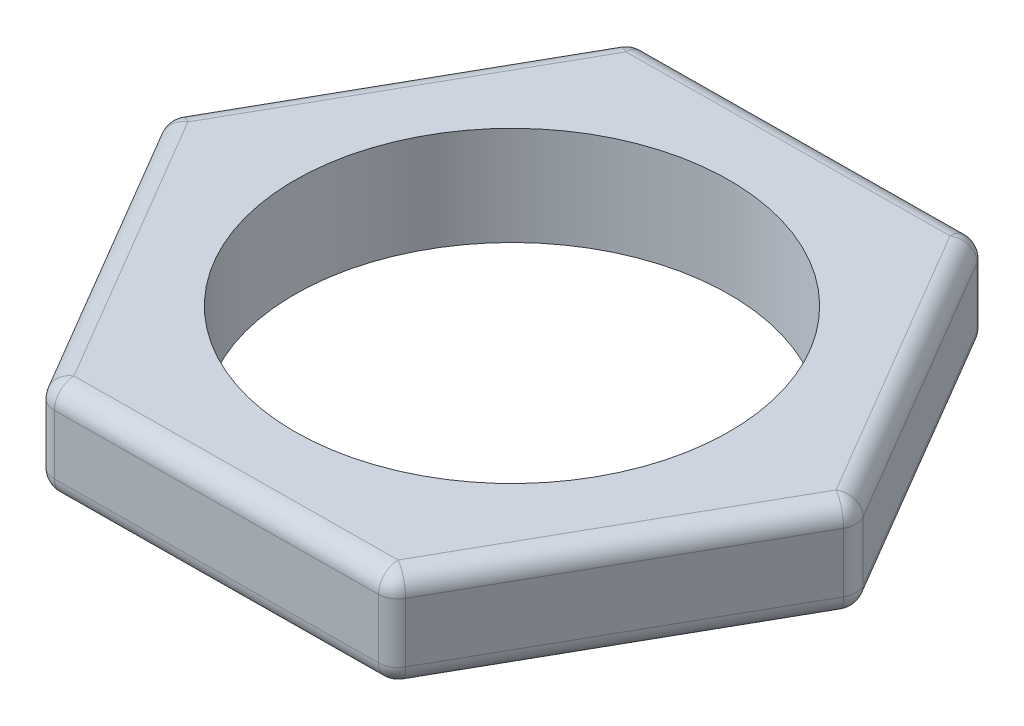
ISO-10303-21;
HEADER;
FILE_DESCRIPTION(('STEP AP214'),'2;1');
FILE_NAME('part.step','',(''),(''),'','','');
FILE_SCHEMA(('AUTOMOTIVE_DESIGN { 1 0 10303 214 1 1 1 1 }'));
ENDSEC;
DATA;
#1=APPLICATION_CONTEXT('core data for automotive mechanical design processes');
#2=APPLICATION_PROTOCOL_DEFINITION('international standard','automotive_design',2000,#1);
#3=PRODUCT_CONTEXT('',#1,'mechanical');
#4=PRODUCT('Part','Part','',(#3));
#5=PRODUCT_RELATED_PRODUCT_CATEGORY('part','',(#4));
#6=PRODUCT_DEFINITION_FORMATION('','',#4);
#7=PRODUCT_DEFINITION_CONTEXT('part definition',#1,'design');
#8=PRODUCT_DEFINITION('design','',#6,#7);
#9=PRODUCT_DEFINITION_SHAPE('','',#8);
#10=(LENGTH_UNIT() NAMED_UNIT(*) SI_UNIT(.MILLI.,.METRE.));
#11=(NAMED_UNIT(*) PLANE_ANGLE_UNIT() SI_UNIT($,.RADIAN.));
#12=(NAMED_UNIT(*) SI_UNIT($,.STERADIAN.) SOLID_ANGLE_UNIT());
#13=UNCERTAINTY_MEASURE_WITH_UNIT(LENGTH_MEASURE(1.E-05),#10,'distance_accuracy_value','');
#14=(GEOMETRIC_REPRESENTATION_CONTEXT(3) GLOBAL_UNCERTAINTY_ASSIGNED_CONTEXT((#13)) GLOBAL_UNIT_ASSIGNED_CONTEXT((#10,
#11,#12)) REPRESENTATION_CONTEXT('',''));
#15=CARTESIAN_POINT('',(0.,0.,0.));
#16=DIRECTION('',(0.,0.,1.));
#17=DIRECTION('',(1.,0.,0.));
#18=AXIS2_PLACEMENT_3D('',#15,#16,#17);
#19=CARTESIAN_POINT('',(16.2508062974145,5.,-0.13738888586725));
#20=DIRECTION('',(0.,1.,0.));
#21=DIRECTION('',(0.,0.,1.));
#22=AXIS2_PLACEMENT_3D('',#19,#20,#21);
#23=CYLINDRICAL_SURFACE('',#22,1.);
#24=CARTESIAN_POINT('',(16.2508062974145,4.,-0.137388885867251));
#25=DIRECTION('',(0.,1.,0.));
#26=DIRECTION('',(0.,0.,1.));
#27=AXIS2_PLACEMENT_3D('',#24,#25,#26);
#28=CIRCLE('',#27,1.);
#29=CARTESIAN_POINT('',(17.121027742863,4.,0.355271885740903));
#30=VERTEX_POINT('',#29);
#31=CARTESIAN_POINT('',(17.1125737637995,4.,-0.64469237873958));
#32=VERTEX_POINT('',#31);
#33=EDGE_CURVE('E11',#30,#32,#28,.T.);
#34=ORIENTED_EDGE('',*,*,#33,.F.);
#35=DIRECTION('',(0.,1.,0.));
#36=VECTOR('',#35,1.);
#37=CARTESIAN_POINT('',(17.121027742863,5.,0.355271885740902));
#38=LINE('',#37,#36);
#39=CARTESIAN_POINT('',(17.121027742863,1.,0.355271885740898));
#40=VERTEX_POINT('',#39);
#41=EDGE_CURVE('E358',#40,#30,#38,.T.);
#42=ORIENTED_EDGE('',*,*,#41,.F.);
#43=CARTESIAN_POINT('',(16.2508062974145,1.,-0.137388885867248));
#44=DIRECTION('',(0.,1.,0.));
#45=DIRECTION('',(0.,0.,1.));
#46=AXIS2_PLACEMENT_3D('',#43,#44,#45);
#47=CIRCLE('',#46,1.);
#48=CARTESIAN_POINT('',(17.1125737637995,1.,-0.64469237873958));
#49=VERTEX_POINT('',#48);
#50=EDGE_CURVE('E43',#40,#49,#47,.T.);
#51=ORIENTED_EDGE('',*,*,#50,.T.);
#52=DIRECTION('',(0.,1.,0.));
#53=VECTOR('',#52,1.);
#54=CARTESIAN_POINT('',(17.1125737637995,5.,-0.644692378739582));
#55=LINE('',#54,#53);
#56=EDGE_CURVE('E361',#32,#49,#55,.F.);
#57=ORIENTED_EDGE('',*,*,#56,.F.);
#58=EDGE_LOOP('',(#34,#42,#51,#57));
#59=FACE_BOUND('',#58,.T.);
#60=ADVANCED_FACE('F35',(#59),#23,.T.);
#61=CARTESIAN_POINT('',(16.2508062974145,1.,-0.137388885867248));
#62=DIRECTION('',(0.,0.,1.));
#63=DIRECTION('',(1.,0.,0.));
#64=AXIS2_PLACEMENT_3D('',#61,#62,#63);
#65=SPHERICAL_SURFACE('',#64,1.);
#66=ORIENTED_EDGE('',*,*,#50,.F.);
#67=CARTESIAN_POINT('',(16.2508062974145,1.,-0.137388885867249));
#68=DIRECTION('',(-0.492660771608151,0.,0.870221445448491));
#69=DIRECTION('',(0.870221445448491,0.,0.492660771608151));
#70=AXIS2_PLACEMENT_3D('',#67,#68,#69);
#71=CIRCLE('',#70,1.);
#72=CARTESIAN_POINT('',(16.2508062974145,0.,-0.137388885867252));
#73=VERTEX_POINT('',#72);
#74=EDGE_CURVE('E353',#73,#40,#71,.T.);
#75=ORIENTED_EDGE('',*,*,#74,.F.);
#76=CARTESIAN_POINT('',(16.2508062974145,1.,-0.137388885867249));
#77=DIRECTION('',(0.507303492872332,0.,0.861767466384948));
#78=DIRECTION('',(0.861767466384948,0.,-0.507303492872332));
#79=AXIS2_PLACEMENT_3D('',#76,#77,#78);
#80=CIRCLE('',#79,1.);
#81=EDGE_CURVE('E356',#49,#73,#80,.F.);
#82=ORIENTED_EDGE('',*,*,#81,.F.);
#83=EDGE_LOOP('',(#66,#75,#82));
#84=FACE_BOUND('',#83,.T.);
#85=ADVANCED_FACE('F376',(#84),#65,.T.);
#86=CARTESIAN_POINT('',(16.2508062974145,4.,-0.137388885867248));
#87=DIRECTION('',(0.,0.,1.));
#88=DIRECTION('',(1.,0.,0.));
#89=AXIS2_PLACEMENT_3D('',#86,#87,#88);
#90=SPHERICAL_SURFACE('',#89,1.);
#91=CARTESIAN_POINT('',(16.2508062974145,4.,-0.137388885867249));
#92=DIRECTION('',(-0.492660771608151,0.,0.870221445448491));
#93=DIRECTION('',(0.870221445448491,0.,0.492660771608151));
#94=AXIS2_PLACEMENT_3D('',#91,#92,#93);
#95=CIRCLE('',#94,1.);
#96=CARTESIAN_POINT('',(16.2508062974145,5.,-0.137388885867252));
#97=VERTEX_POINT('',#96);
#98=EDGE_CURVE('E364',#30,#97,#95,.T.);
#99=ORIENTED_EDGE('',*,*,#98,.F.);
#100=ORIENTED_EDGE('',*,*,#33,.T.);
#101=CARTESIAN_POINT('',(16.2508062974145,4.,-0.137388885867249));
#102=DIRECTION('',(0.507303492872332,0.,0.861767466384948));
#103=DIRECTION('',(0.861767466384948,0.,-0.507303492872332));
#104=AXIS2_PLACEMENT_3D('',#101,#102,#103);
#105=CIRCLE('',#104,1.);
#106=EDGE_CURVE('E367',#97,#32,#105,.F.);
#107=ORIENTED_EDGE('',*,*,#106,.F.);
#108=EDGE_LOOP('',(#99,#100,#107));
#109=FACE_BOUND('',#108,.T.);
#110=ADVANCED_FACE('F37',(#109),#90,.T.);
#111=CARTESIAN_POINT('',(8.0064208833486,5.,-14.1423055284747));
#112=DIRECTION('',(0.,1.,0.));
#113=DIRECTION('',(0.,0.,1.));
#114=AXIS2_PLACEMENT_3D('',#111,#112,#113);
#115=CYLINDRICAL_SURFACE('',#114,1.);
#116=CARTESIAN_POINT('',(8.00642088334859,4.,-14.1423055284748));
#117=DIRECTION('',(0.,1.,0.));
#118=DIRECTION('',(0.,0.,1.));
#119=AXIS2_PLACEMENT_3D('',#116,#117,#118);
#120=CIRCLE('',#119,1.);
#121=CARTESIAN_POINT('',(8.86818834973354,4.,-14.6496090213471));
#122=VERTEX_POINT('',#121);
#123=CARTESIAN_POINT('',(7.99796690428505,4.,-15.1422697929552));
#124=VERTEX_POINT('',#123);
#125=EDGE_CURVE('E351',#122,#124,#120,.T.);
#126=ORIENTED_EDGE('',*,*,#125,.F.);
#127=DIRECTION('',(0.,1.,0.));
#128=VECTOR('',#127,1.);
#129=CARTESIAN_POINT('',(8.86818834973354,5.,-14.6496090213471));
#130=LINE('',#129,#128);
#131=CARTESIAN_POINT('',(8.86818834973354,1.,-14.6496090213471));
#132=VERTEX_POINT('',#131);
#133=EDGE_CURVE('E337',#132,#122,#130,.T.);
#134=ORIENTED_EDGE('',*,*,#133,.F.);
#135=CARTESIAN_POINT('',(8.0064208833486,1.,-14.1423055284748));
#136=DIRECTION('',(0.,1.,0.));
#137=DIRECTION('',(0.,0.,1.));
#138=AXIS2_PLACEMENT_3D('',#135,#136,#137);
#139=CIRCLE('',#138,1.);
#140=CARTESIAN_POINT('',(7.99796690428505,1.,-15.1422697929552));
#141=VERTEX_POINT('',#140);
#142=EDGE_CURVE('E349',#132,#141,#139,.T.);
#143=ORIENTED_EDGE('',*,*,#142,.T.);
#144=DIRECTION('',(0.,1.,0.));
#145=VECTOR('',#144,1.);
#146=CARTESIAN_POINT('',(7.99796690428505,5.,-15.1422697929552));
#147=LINE('',#146,#145);
#148=EDGE_CURVE('E340',#124,#141,#147,.F.);
#149=ORIENTED_EDGE('',*,*,#148,.F.);
#150=EDGE_LOOP('',(#126,#134,#143,#149));
#151=FACE_BOUND('',#150,.T.);
#152=ADVANCED_FACE('F410',(#151),#115,.T.);
#153=CARTESIAN_POINT('',(8.0064208833486,1.,-14.1423055284748));
#154=DIRECTION('',(0.,0.,1.));
#155=DIRECTION('',(1.,0.,0.));
#156=AXIS2_PLACEMENT_3D('',#153,#154,#155);
#157=SPHERICAL_SURFACE('',#156,1.);
#158=ORIENTED_EDGE('',*,*,#142,.F.);
#159=CARTESIAN_POINT('',(8.0064208833486,1.,-14.1423055284748));
#160=DIRECTION('',(0.507303492872332,0.,0.861767466384948));
#161=DIRECTION('',(0.861767466384948,0.,-0.507303492872332));
#162=AXIS2_PLACEMENT_3D('',#159,#160,#161);
#163=CIRCLE('',#162,1.);
#164=CARTESIAN_POINT('',(8.0064208833486,0.,-14.1423055284747));
#165=VERTEX_POINT('',#164);
#166=EDGE_CURVE('E332',#165,#132,#163,.T.);
#167=ORIENTED_EDGE('',*,*,#166,.F.);
#168=CARTESIAN_POINT('',(8.0064208833486,1.,-14.1423055284748));
#169=DIRECTION('',(0.999964264480483,0.,-0.00845397906354309));
#170=DIRECTION('',(-0.00845397906354309,0.,-0.999964264480483));
#171=AXIS2_PLACEMENT_3D('',#168,#169,#170);
#172=CIRCLE('',#171,1.);
#173=EDGE_CURVE('E335',#141,#165,#172,.F.);
#174=ORIENTED_EDGE('',*,*,#173,.F.);
#175=EDGE_LOOP('',(#158,#167,#174));
#176=FACE_BOUND('',#175,.T.);
#177=ADVANCED_FACE('F383',(#176),#157,.T.);
#178=CARTESIAN_POINT('',(8.0064208833486,4.,-14.1423055284748));
#179=DIRECTION('',(0.,0.,1.));
#180=DIRECTION('',(1.,0.,0.));
#181=AXIS2_PLACEMENT_3D('',#178,#179,#180);
#182=SPHERICAL_SURFACE('',#181,1.);
#183=CARTESIAN_POINT('',(8.0064208833486,4.,-14.1423055284748));
#184=DIRECTION('',(0.507303492872332,0.,0.861767466384948));
#185=DIRECTION('',(0.861767466384948,0.,-0.507303492872332));
#186=AXIS2_PLACEMENT_3D('',#183,#184,#185);
#187=CIRCLE('',#186,1.);
#188=CARTESIAN_POINT('',(8.00642088334859,5.,-14.1423055284748));
#189=VERTEX_POINT('',#188);
#190=EDGE_CURVE('E343',#122,#189,#187,.T.);
#191=ORIENTED_EDGE('',*,*,#190,.F.);
#192=ORIENTED_EDGE('',*,*,#125,.T.);
#193=CARTESIAN_POINT('',(8.0064208833486,4.,-14.1423055284748));
#194=DIRECTION('',(0.999964264480483,0.,-0.00845397906354309));
#195=DIRECTION('',(-0.00845397906354309,0.,-0.999964264480483));
#196=AXIS2_PLACEMENT_3D('',#193,#194,#195);
#197=CIRCLE('',#196,1.);
#198=EDGE_CURVE('E346',#189,#124,#197,.F.);
#199=ORIENTED_EDGE('',*,*,#198,.F.);
#200=EDGE_LOOP('',(#191,#192,#199));
#201=FACE_BOUND('',#200,.T.);
#202=ADVANCED_FACE('F449',(#201),#182,.T.);
#203=CARTESIAN_POINT('',(-8.24438541406595,5.,-14.0049166426075));
#204=DIRECTION('',(0.,-1.,0.));
#205=DIRECTION('',(0.,0.,-1.));
#206=AXIS2_PLACEMENT_3D('',#203,#204,#205);
#207=CYLINDRICAL_SURFACE('',#206,1.);
#208=CARTESIAN_POINT('',(-8.24438541406595,1.,-14.0049166426075));
#209=DIRECTION('',(0.,-1.,0.));
#210=DIRECTION('',(0.,0.,-1.));
#211=AXIS2_PLACEMENT_3D('',#208,#209,#210);
#212=CIRCLE('',#211,1.);
#213=CARTESIAN_POINT('',(-9.11460685951443,1.,-14.4975774142157));
#214=VERTEX_POINT('',#213);
#215=CARTESIAN_POINT('',(-8.25283939312948,1.,-15.004880907088));
#216=VERTEX_POINT('',#215);
#217=EDGE_CURVE('E329',#214,#216,#212,.T.);
#218=ORIENTED_EDGE('',*,*,#217,.F.);
#219=DIRECTION('',(0.,-1.,0.));
#220=VECTOR('',#219,1.);
#221=CARTESIAN_POINT('',(-9.11460685951444,5.,-14.4975774142156));
#222=LINE('',#221,#220);
#223=CARTESIAN_POINT('',(-9.11460685951444,4.,-14.4975774142157));
#224=VERTEX_POINT('',#223);
#225=EDGE_CURVE('E315',#224,#214,#222,.T.);
#226=ORIENTED_EDGE('',*,*,#225,.F.);
#227=CARTESIAN_POINT('',(-8.24438541406594,4.,-14.0049166426075));
#228=DIRECTION('',(0.,-1.,0.));
#229=DIRECTION('',(0.,0.,-1.));
#230=AXIS2_PLACEMENT_3D('',#227,#228,#229);
#231=CIRCLE('',#230,1.);
#232=CARTESIAN_POINT('',(-8.25283939312949,4.,-15.004880907088));
#233=VERTEX_POINT('',#232);
#234=EDGE_CURVE('E327',#224,#233,#231,.T.);
#235=ORIENTED_EDGE('',*,*,#234,.T.);
#236=DIRECTION('',(0.,-1.,0.));
#237=VECTOR('',#236,1.);
#238=CARTESIAN_POINT('',(-8.25283939312949,5.,-15.004880907088));
#239=LINE('',#238,#237);
#240=EDGE_CURVE('E318',#216,#233,#239,.F.);
#241=ORIENTED_EDGE('',*,*,#240,.F.);
#242=EDGE_LOOP('',(#218,#226,#235,#241));
#243=FACE_BOUND('',#242,.T.);
#244=ADVANCED_FACE('F399',(#243),#207,.T.);
#245=CARTESIAN_POINT('',(-8.24438541406594,4.,-14.0049166426075));
#246=DIRECTION('',(0.,0.,1.));
#247=DIRECTION('',(1.,0.,0.));
#248=AXIS2_PLACEMENT_3D('',#245,#246,#247);
#249=SPHERICAL_SURFACE('',#248,1.);
#250=ORIENTED_EDGE('',*,*,#234,.F.);
#251=CARTESIAN_POINT('',(-8.24438541406594,4.,-14.0049166426075));
#252=DIRECTION('',(0.492660771608151,0.,-0.870221445448491));
#253=DIRECTION('',(-0.870221445448491,0.,-0.492660771608151));
#254=AXIS2_PLACEMENT_3D('',#251,#252,#253);
#255=CIRCLE('',#254,1.);
#256=CARTESIAN_POINT('',(-8.24438541406594,5.,-14.0049166426075));
#257=VERTEX_POINT('',#256);
#258=EDGE_CURVE('E310',#257,#224,#255,.F.);
#259=ORIENTED_EDGE('',*,*,#258,.F.);
#260=CARTESIAN_POINT('',(-8.24438541406594,4.,-14.0049166426075));
#261=DIRECTION('',(0.999964264480483,0.,-0.00845397906354309));
#262=DIRECTION('',(-0.00845397906354309,0.,-0.999964264480483));
#263=AXIS2_PLACEMENT_3D('',#260,#261,#262);
#264=CIRCLE('',#263,1.);
#265=EDGE_CURVE('E313',#233,#257,#264,.T.);
#266=ORIENTED_EDGE('',*,*,#265,.F.);
#267=EDGE_LOOP('',(#250,#259,#266));
#268=FACE_BOUND('',#267,.T.);
#269=ADVANCED_FACE('F402',(#268),#249,.T.);
#270=CARTESIAN_POINT('',(-8.24438541406594,1.,-14.0049166426075));
#271=DIRECTION('',(0.,0.,1.));
#272=DIRECTION('',(1.,0.,0.));
#273=AXIS2_PLACEMENT_3D('',#270,#271,#272);
#274=SPHERICAL_SURFACE('',#273,1.);
#275=CARTESIAN_POINT('',(-8.24438541406594,1.,-14.0049166426075));
#276=DIRECTION('',(0.492660771608151,0.,-0.870221445448491));
#277=DIRECTION('',(-0.870221445448491,0.,-0.492660771608151));
#278=AXIS2_PLACEMENT_3D('',#275,#276,#277);
#279=CIRCLE('',#278,1.);
#280=CARTESIAN_POINT('',(-8.24438541406595,0.,-14.0049166426075));
#281=VERTEX_POINT('',#280);
#282=EDGE_CURVE('E321',#214,#281,#279,.F.);
#283=ORIENTED_EDGE('',*,*,#282,.F.);
#284=ORIENTED_EDGE('',*,*,#217,.T.);
#285=CARTESIAN_POINT('',(-8.24438541406594,1.,-14.0049166426075));
#286=DIRECTION('',(0.999964264480483,0.,-0.00845397906354309));
#287=DIRECTION('',(-0.00845397906354309,0.,-0.999964264480483));
#288=AXIS2_PLACEMENT_3D('',#285,#286,#287);
#289=CIRCLE('',#288,1.);
#290=EDGE_CURVE('E324',#281,#216,#289,.T.);
#291=ORIENTED_EDGE('',*,*,#290,.F.);
#292=EDGE_LOOP('',(#283,#284,#291));
#293=FACE_BOUND('',#292,.T.);
#294=ADVANCED_FACE('F396',(#293),#274,.T.);
#295=CARTESIAN_POINT('',(-16.2508062974145,5.,0.137388885867248));
#296=DIRECTION('',(0.,-1.,0.));
#297=DIRECTION('',(0.,0.,-1.));
#298=AXIS2_PLACEMENT_3D('',#295,#296,#297);
#299=CYLINDRICAL_SURFACE('',#298,1.);
#300=CARTESIAN_POINT('',(-16.2508062974145,1.,0.137388885867246));
#301=DIRECTION('',(0.,-1.,0.));
#302=DIRECTION('',(0.,0.,-1.));
#303=AXIS2_PLACEMENT_3D('',#300,#301,#302);
#304=CIRCLE('',#303,1.);
#305=CARTESIAN_POINT('',(-17.1125737637995,1.,0.644692378739582));
#306=VERTEX_POINT('',#305);
#307=CARTESIAN_POINT('',(-17.121027742863,1.,-0.355271885740903));
#308=VERTEX_POINT('',#307);
#309=EDGE_CURVE('E307',#306,#308,#304,.T.);
#310=ORIENTED_EDGE('',*,*,#309,.F.);
#311=DIRECTION('',(0.,-1.,0.));
#312=VECTOR('',#311,1.);
#313=CARTESIAN_POINT('',(-17.1125737637995,5.,0.64469237873958));
#314=LINE('',#313,#312);
#315=CARTESIAN_POINT('',(-17.1125737637995,4.,0.64469237873958));
#316=VERTEX_POINT('',#315);
#317=EDGE_CURVE('E295',#316,#306,#314,.T.);
#318=ORIENTED_EDGE('',*,*,#317,.F.);
#319=CARTESIAN_POINT('',(-16.2508062974145,4.,0.13738888586725));
#320=DIRECTION('',(0.,-1.,0.));
#321=DIRECTION('',(0.,0.,-1.));
#322=AXIS2_PLACEMENT_3D('',#319,#320,#321);
#323=CIRCLE('',#322,1.);
#324=CARTESIAN_POINT('',(-17.121027742863,4.,-0.355271885740904));
#325=VERTEX_POINT('',#324);
#326=EDGE_CURVE('E305',#316,#325,#323,.T.);
#327=ORIENTED_EDGE('',*,*,#326,.T.);
#328=DIRECTION('',(0.,-1.,0.));
#329=VECTOR('',#328,1.);
#330=CARTESIAN_POINT('',(-17.121027742863,5.,-0.355271885740907));
#331=LINE('',#330,#329);
#332=EDGE_CURVE('E298',#308,#325,#331,.F.);
#333=ORIENTED_EDGE('',*,*,#332,.F.);
#334=EDGE_LOOP('',(#310,#318,#327,#333));
#335=FACE_BOUND('',#334,.T.);
#336=ADVANCED_FACE('F458',(#335),#299,.T.);
#337=CARTESIAN_POINT('',(-16.2508062974145,4.,0.13738888586725));
#338=DIRECTION('',(0.,0.,1.));
#339=DIRECTION('',(1.,0.,0.));
#340=AXIS2_PLACEMENT_3D('',#337,#338,#339);
#341=SPHERICAL_SURFACE('',#340,1.);
#342=ORIENTED_EDGE('',*,*,#326,.F.);
#343=CARTESIAN_POINT('',(-16.2508062974145,4.,0.137388885867251));
#344=DIRECTION('',(-0.507303492872331,0.,-0.861767466384948));
#345=DIRECTION('',(-0.861767466384948,0.,0.507303492872331));
#346=AXIS2_PLACEMENT_3D('',#343,#344,#345);
#347=CIRCLE('',#346,1.);
#348=CARTESIAN_POINT('',(-16.2508062974145,5.,0.137388885867245));
#349=VERTEX_POINT('',#348);
#350=EDGE_CURVE('E290',#349,#316,#347,.F.);
#351=ORIENTED_EDGE('',*,*,#350,.F.);
#352=CARTESIAN_POINT('',(-16.2508062974145,4.,0.137388885867248));
#353=DIRECTION('',(0.492660771608151,0.,-0.870221445448491));
#354=DIRECTION('',(-0.870221445448491,0.,-0.492660771608151));
#355=AXIS2_PLACEMENT_3D('',#352,#353,#354);
#356=CIRCLE('',#355,1.);
#357=EDGE_CURVE('E293',#325,#349,#356,.T.);
#358=ORIENTED_EDGE('',*,*,#357,.F.);
#359=EDGE_LOOP('',(#342,#351,#358));
#360=FACE_BOUND('',#359,.T.);
#361=ADVANCED_FACE('F467',(#360),#341,.T.);
#362=CARTESIAN_POINT('',(-16.2508062974145,1.,0.13738888586725));
#363=DIRECTION('',(0.,0.,1.));
#364=DIRECTION('',(1.,0.,0.));
#365=AXIS2_PLACEMENT_3D('',#362,#363,#364);
#366=SPHERICAL_SURFACE('',#365,1.);
#367=CARTESIAN_POINT('',(-16.2508062974145,1.,0.137388885867251));
#368=DIRECTION('',(-0.507303492872331,0.,-0.861767466384948));
#369=DIRECTION('',(-0.861767466384948,0.,0.507303492872331));
#370=AXIS2_PLACEMENT_3D('',#367,#368,#369);
#371=CIRCLE('',#370,1.);
#372=CARTESIAN_POINT('',(-16.2508062974145,0.,0.137388885867245));
#373=VERTEX_POINT('',#372);
#374=EDGE_CURVE('E194',#306,#373,#371,.F.);
#375=ORIENTED_EDGE('',*,*,#374,.F.);
#376=ORIENTED_EDGE('',*,*,#309,.T.);
#377=CARTESIAN_POINT('',(-16.2508062974145,1.,0.137388885867248));
#378=DIRECTION('',(0.492660771608151,0.,-0.870221445448491));
#379=DIRECTION('',(-0.870221445448491,0.,-0.492660771608151));
#380=AXIS2_PLACEMENT_3D('',#377,#378,#379);
#381=CIRCLE('',#380,1.);
#382=EDGE_CURVE('E302',#373,#308,#381,.T.);
#383=ORIENTED_EDGE('',*,*,#382,.F.);
#384=EDGE_LOOP('',(#375,#376,#383));
#385=FACE_BOUND('',#384,.T.);
#386=ADVANCED_FACE('F463',(#385),#366,.T.);
#387=CARTESIAN_POINT('',(-8.00642088334859,5.,14.1423055284748));
#388=DIRECTION('',(0.,-1.,0.));
#389=DIRECTION('',(0.,0.,-1.));
#390=AXIS2_PLACEMENT_3D('',#387,#388,#389);
#391=CYLINDRICAL_SURFACE('',#390,1.);
#392=CARTESIAN_POINT('',(-8.00642088334859,1.,14.1423055284748));
#393=DIRECTION('',(0.,-1.,0.));
#394=DIRECTION('',(0.,0.,-1.));
#395=AXIS2_PLACEMENT_3D('',#392,#393,#394);
#396=CIRCLE('',#395,1.);
#397=CARTESIAN_POINT('',(-7.99796690428504,1.,15.1422697929552));
#398=VERTEX_POINT('',#397);
#399=CARTESIAN_POINT('',(-8.86818834973353,1.,14.6496090213471));
#400=VERTEX_POINT('',#399);
#401=EDGE_CURVE('E163',#398,#400,#396,.T.);
#402=ORIENTED_EDGE('',*,*,#401,.F.);
#403=DIRECTION('',(0.,-1.,0.));
#404=VECTOR('',#403,1.);
#405=CARTESIAN_POINT('',(-7.99796690428504,5.,15.1422697929552));
#406=LINE('',#405,#404);
#407=CARTESIAN_POINT('',(-7.99796690428504,4.,15.1422697929552));
#408=VERTEX_POINT('',#407);
#409=EDGE_CURVE('E284',#408,#398,#406,.T.);
#410=ORIENTED_EDGE('',*,*,#409,.F.);
#411=CARTESIAN_POINT('',(-8.00642088334858,4.,14.1423055284748));
#412=DIRECTION('',(0.,-1.,0.));
#413=DIRECTION('',(0.,0.,-1.));
#414=AXIS2_PLACEMENT_3D('',#411,#412,#413);
#415=CIRCLE('',#414,1.);
#416=CARTESIAN_POINT('',(-8.86818834973353,4.,14.6496090213471));
#417=VERTEX_POINT('',#416);
#418=EDGE_CURVE('E168',#408,#417,#415,.T.);
#419=ORIENTED_EDGE('',*,*,#418,.T.);
#420=DIRECTION('',(0.,-1.,0.));
#421=VECTOR('',#420,1.);
#422=CARTESIAN_POINT('',(-8.86818834973353,5.,14.6496090213471));
#423=LINE('',#422,#421);
#424=EDGE_CURVE('E178',#400,#417,#423,.F.);
#425=ORIENTED_EDGE('',*,*,#424,.F.);
#426=EDGE_LOOP('',(#402,#410,#419,#425));
#427=FACE_BOUND('',#426,.T.);
#428=ADVANCED_FACE('F466',(#427),#391,.T.);
#429=CARTESIAN_POINT('',(-8.00642088334858,4.,14.1423055284748));
#430=DIRECTION('',(0.,0.,1.));
#431=DIRECTION('',(1.,0.,0.));
#432=AXIS2_PLACEMENT_3D('',#429,#430,#431);
#433=SPHERICAL_SURFACE('',#432,1.);
#434=ORIENTED_EDGE('',*,*,#418,.F.);
#435=CARTESIAN_POINT('',(-8.00642088334858,4.,14.1423055284748));
#436=DIRECTION('',(-0.999964264480483,0.,0.00845397906354309));
#437=DIRECTION('',(0.00845397906354309,0.,0.999964264480483));
#438=AXIS2_PLACEMENT_3D('',#435,#436,#437);
#439=CIRCLE('',#438,1.);
#440=CARTESIAN_POINT('',(-8.00642088334859,5.,14.1423055284748));
#441=VERTEX_POINT('',#440);
#442=EDGE_CURVE('E279',#441,#408,#439,.F.);
#443=ORIENTED_EDGE('',*,*,#442,.F.);
#444=CARTESIAN_POINT('',(-8.00642088334858,4.,14.1423055284748));
#445=DIRECTION('',(-0.507303492872331,0.,-0.861767466384948));
#446=DIRECTION('',(-0.861767466384948,0.,0.507303492872331));
#447=AXIS2_PLACEMENT_3D('',#444,#445,#446);
#448=CIRCLE('',#447,1.);
#449=EDGE_CURVE('E282',#417,#441,#448,.T.);
#450=ORIENTED_EDGE('',*,*,#449,.F.);
#451=EDGE_LOOP('',(#434,#443,#450));
#452=FACE_BOUND('',#451,.T.);
#453=ADVANCED_FACE('F477',(#452),#433,.T.);
#454=CARTESIAN_POINT('',(-8.00642088334858,1.,14.1423055284748));
#455=DIRECTION('',(0.,0.,1.));
#456=DIRECTION('',(1.,0.,0.));
#457=AXIS2_PLACEMENT_3D('',#454,#455,#456);
#458=SPHERICAL_SURFACE('',#457,1.);
#459=CARTESIAN_POINT('',(-8.00642088334858,1.,14.1423055284748));
#460=DIRECTION('',(-0.999964264480483,0.,0.00845397906354309));
#461=DIRECTION('',(0.00845397906354309,0.,0.999964264480483));
#462=AXIS2_PLACEMENT_3D('',#459,#460,#461);
#463=CIRCLE('',#462,1.);
#464=CARTESIAN_POINT('',(-8.00642088334858,0.,14.1423055284748));
#465=VERTEX_POINT('',#464);
#466=EDGE_CURVE('E161',#398,#465,#463,.F.);
#467=ORIENTED_EDGE('',*,*,#466,.F.);
#468=ORIENTED_EDGE('',*,*,#401,.T.);
#469=CARTESIAN_POINT('',(-8.00642088334858,1.,14.1423055284748));
#470=DIRECTION('',(-0.507303492872331,0.,-0.861767466384948));
#471=DIRECTION('',(-0.861767466384948,0.,0.507303492872331));
#472=AXIS2_PLACEMENT_3D('',#469,#470,#471);
#473=CIRCLE('',#472,1.);
#474=EDGE_CURVE('E158',#465,#400,#473,.T.);
#475=ORIENTED_EDGE('',*,*,#474,.F.);
#476=EDGE_LOOP('',(#467,#468,#475));
#477=FACE_BOUND('',#476,.T.);
#478=ADVANCED_FACE('F160',(#477),#458,.T.);
#479=CARTESIAN_POINT('',(8.24438541406595,5.,14.0049166426075));
#480=DIRECTION('',(0.,1.,0.));
#481=DIRECTION('',(0.,0.,1.));
#482=AXIS2_PLACEMENT_3D('',#479,#480,#481);
#483=CYLINDRICAL_SURFACE('',#482,1.);
#484=CARTESIAN_POINT('',(8.24438541406595,4.,14.0049166426075));
#485=DIRECTION('',(0.,1.,0.));
#486=DIRECTION('',(0.,0.,1.));
#487=AXIS2_PLACEMENT_3D('',#484,#485,#486);
#488=CIRCLE('',#487,1.);
#489=CARTESIAN_POINT('',(8.25283939312948,4.,15.004880907088));
#490=VERTEX_POINT('',#489);
#491=CARTESIAN_POINT('',(9.11460685951443,4.,14.4975774142157));
#492=VERTEX_POINT('',#491);
#493=EDGE_CURVE('E276',#490,#492,#488,.T.);
#494=ORIENTED_EDGE('',*,*,#493,.F.);
#495=DIRECTION('',(0.,1.,0.));
#496=VECTOR('',#495,1.);
#497=CARTESIAN_POINT('',(8.25283939312949,5.,15.004880907088));
#498=LINE('',#497,#496);
#499=CARTESIAN_POINT('',(8.25283939312949,1.,15.004880907088));
#500=VERTEX_POINT('',#499);
#501=EDGE_CURVE('E262',#500,#490,#498,.T.);
#502=ORIENTED_EDGE('',*,*,#501,.F.);
#503=CARTESIAN_POINT('',(8.24438541406594,1.,14.0049166426075));
#504=DIRECTION('',(0.,1.,0.));
#505=DIRECTION('',(0.,0.,1.));
#506=AXIS2_PLACEMENT_3D('',#503,#504,#505);
#507=CIRCLE('',#506,1.);
#508=CARTESIAN_POINT('',(9.11460685951444,1.,14.4975774142157));
#509=VERTEX_POINT('',#508);
#510=EDGE_CURVE('E274',#500,#509,#507,.T.);
#511=ORIENTED_EDGE('',*,*,#510,.T.);
#512=DIRECTION('',(0.,1.,0.));
#513=VECTOR('',#512,1.);
#514=CARTESIAN_POINT('',(9.11460685951444,5.,14.4975774142157));
#515=LINE('',#514,#513);
#516=EDGE_CURVE('E265',#492,#509,#515,.F.);
#517=ORIENTED_EDGE('',*,*,#516,.F.);
#518=EDGE_LOOP('',(#494,#502,#511,#517));
#519=FACE_BOUND('',#518,.T.);
#520=ADVANCED_FACE('F427',(#519),#483,.T.);
#521=CARTESIAN_POINT('',(8.24438541406594,1.,14.0049166426075));
#522=DIRECTION('',(0.,0.,1.));
#523=DIRECTION('',(1.,0.,0.));
#524=AXIS2_PLACEMENT_3D('',#521,#522,#523);
#525=SPHERICAL_SURFACE('',#524,1.);
#526=ORIENTED_EDGE('',*,*,#510,.F.);
#527=CARTESIAN_POINT('',(8.24438541406594,1.,14.0049166426075));
#528=DIRECTION('',(-0.999964264480483,0.,0.00845397906354309));
#529=DIRECTION('',(0.00845397906354309,0.,0.999964264480483));
#530=AXIS2_PLACEMENT_3D('',#527,#528,#529);
#531=CIRCLE('',#530,1.);
#532=CARTESIAN_POINT('',(8.24438541406595,0.,14.0049166426075));
#533=VERTEX_POINT('',#532);
#534=EDGE_CURVE('E258',#533,#500,#531,.T.);
#535=ORIENTED_EDGE('',*,*,#534,.F.);
#536=CARTESIAN_POINT('',(8.24438541406594,1.,14.0049166426075));
#537=DIRECTION('',(-0.492660771608151,0.,0.870221445448491));
#538=DIRECTION('',(0.870221445448491,0.,0.492660771608151));
#539=AXIS2_PLACEMENT_3D('',#536,#537,#538);
#540=CIRCLE('',#539,1.);
#541=EDGE_CURVE('E260',#509,#533,#540,.F.);
#542=ORIENTED_EDGE('',*,*,#541,.F.);
#543=EDGE_LOOP('',(#526,#535,#542));
#544=FACE_BOUND('',#543,.T.);
#545=ADVANCED_FACE('F431',(#544),#525,.T.);
#546=CARTESIAN_POINT('',(8.24438541406594,4.,14.0049166426075));
#547=DIRECTION('',(0.,0.,1.));
#548=DIRECTION('',(1.,0.,0.));
#549=AXIS2_PLACEMENT_3D('',#546,#547,#548);
#550=SPHERICAL_SURFACE('',#549,1.);
#551=CARTESIAN_POINT('',(8.24438541406594,4.,14.0049166426075));
#552=DIRECTION('',(-0.999964264480483,0.,0.00845397906354309));
#553=DIRECTION('',(0.00845397906354309,0.,0.999964264480483));
#554=AXIS2_PLACEMENT_3D('',#551,#552,#553);
#555=CIRCLE('',#554,1.);
#556=CARTESIAN_POINT('',(8.24438541406594,5.,14.0049166426075));
#557=VERTEX_POINT('',#556);
#558=EDGE_CURVE('E268',#490,#557,#555,.T.);
#559=ORIENTED_EDGE('',*,*,#558,.F.);
#560=ORIENTED_EDGE('',*,*,#493,.T.);
#561=CARTESIAN_POINT('',(8.24438541406594,4.,14.0049166426075));
#562=DIRECTION('',(-0.492660771608151,0.,0.870221445448491));
#563=DIRECTION('',(0.870221445448491,0.,0.492660771608151));
#564=AXIS2_PLACEMENT_3D('',#561,#562,#563);
#565=CIRCLE('',#564,1.);
#566=EDGE_CURVE('E271',#557,#492,#565,.F.);
#567=ORIENTED_EDGE('',*,*,#566,.F.);
#568=EDGE_LOOP('',(#559,#560,#567));
#569=FACE_BOUND('',#568,.T.);
#570=ADVANCED_FACE('F424',(#569),#550,.T.);
#571=CARTESIAN_POINT('',(12.2475958557402,4.,6.93376387837013));
#572=DIRECTION('',(-0.492660771608151,0.,0.870221445448491));
#573=DIRECTION('',(0.870221445448491,0.,0.492660771608151));
#574=AXIS2_PLACEMENT_3D('',#571,#572,#573);
#575=CYLINDRICAL_SURFACE('',#574,1.);
#576=DIRECTION('',(0.492660771608151,0.,-0.870221445448491));
#577=VECTOR('',#576,1.);
#578=CARTESIAN_POINT('',(13.1178173011887,4.,7.42642464997828));
#579=LINE('',#578,#577);
#580=EDGE_CURVE('E256',#30,#492,#579,.F.);
#581=ORIENTED_EDGE('',*,*,#580,.F.);
#582=ORIENTED_EDGE('',*,*,#98,.T.);
#583=DIRECTION('',(0.492660771608151,0.,-0.870221445448491));
#584=VECTOR('',#583,1.);
#585=CARTESIAN_POINT('',(12.2475958557402,5.,6.93376387837013));
#586=LINE('',#585,#584);
#587=EDGE_CURVE('E223',#557,#97,#586,.T.);
#588=ORIENTED_EDGE('',*,*,#587,.F.);
#589=ORIENTED_EDGE('',*,*,#566,.T.);
#590=EDGE_LOOP('',(#581,#582,#588,#589));
#591=FACE_BOUND('',#590,.T.);
#592=ADVANCED_FACE('F417',(#591),#575,.T.);
#593=CARTESIAN_POINT('',(0.118982265358679,4.,14.0736110855411));
#594=DIRECTION('',(-0.999964264480483,0.,0.00845397906354309));
#595=DIRECTION('',(0.00845397906354309,0.,0.999964264480483));
#596=AXIS2_PLACEMENT_3D('',#593,#594,#595);
#597=CYLINDRICAL_SURFACE('',#596,1.);
#598=DIRECTION('',(0.999964264480483,0.,-0.00845397906354309));
#599=VECTOR('',#598,1.);
#600=CARTESIAN_POINT('',(0.118982265358679,5.,14.0736110855411));
#601=LINE('',#600,#599);
#602=EDGE_CURVE('E226',#441,#557,#601,.T.);
#603=ORIENTED_EDGE('',*,*,#602,.F.);
#604=ORIENTED_EDGE('',*,*,#442,.T.);
#605=DIRECTION('',(0.999964264480483,0.,-0.00845397906354309));
#606=VECTOR('',#605,1.);
#607=CARTESIAN_POINT('',(0.127436244422222,4.,15.0735753500216));
#608=LINE('',#607,#606);
#609=EDGE_CURVE('E253',#490,#408,#608,.F.);
#610=ORIENTED_EDGE('',*,*,#609,.F.);
#611=ORIENTED_EDGE('',*,*,#558,.T.);
#612=EDGE_LOOP('',(#603,#604,#610,#611));
#613=FACE_BOUND('',#612,.T.);
#614=ADVANCED_FACE('F492',(#613),#597,.T.);
#615=CARTESIAN_POINT('',(-12.1286135903816,4.,7.13984720717099));
#616=DIRECTION('',(-0.507303492872331,0.,-0.861767466384948));
#617=DIRECTION('',(-0.861767466384948,0.,0.507303492872331));
#618=AXIS2_PLACEMENT_3D('',#615,#616,#617);
#619=CYLINDRICAL_SURFACE('',#618,1.);
#620=DIRECTION('',(0.507303492872331,0.,0.861767466384948));
#621=VECTOR('',#620,1.);
#622=CARTESIAN_POINT('',(-12.1286135903816,5.,7.13984720717099));
#623=LINE('',#622,#621);
#624=EDGE_CURVE('E229',#349,#441,#623,.T.);
#625=ORIENTED_EDGE('',*,*,#624,.F.);
#626=ORIENTED_EDGE('',*,*,#350,.T.);
#627=DIRECTION('',(0.507303492872331,0.,0.861767466384948));
#628=VECTOR('',#627,1.);
#629=CARTESIAN_POINT('',(-12.9903810567665,4.,7.64715070004333));
#630=LINE('',#629,#628);
#631=EDGE_CURVE('E250',#417,#316,#630,.F.);
#632=ORIENTED_EDGE('',*,*,#631,.F.);
#633=ORIENTED_EDGE('',*,*,#449,.T.);
#634=EDGE_LOOP('',(#625,#626,#632,#633));
#635=FACE_BOUND('',#634,.T.);
#636=ADVANCED_FACE('F495',(#635),#619,.T.);
#637=CARTESIAN_POINT('',(-12.2475958557402,4.,-6.93376387837012));
#638=DIRECTION('',(0.492660771608151,0.,-0.870221445448491));
#639=DIRECTION('',(-0.870221445448491,0.,-0.492660771608151));
#640=AXIS2_PLACEMENT_3D('',#637,#638,#639);
#641=CYLINDRICAL_SURFACE('',#640,1.);
#642=DIRECTION('',(-0.492660771608151,0.,0.870221445448491));
#643=VECTOR('',#642,1.);
#644=CARTESIAN_POINT('',(-12.2475958557402,5.,-6.93376387837012));
#645=LINE('',#644,#643);
#646=EDGE_CURVE('E232',#257,#349,#645,.T.);
#647=ORIENTED_EDGE('',*,*,#646,.F.);
#648=ORIENTED_EDGE('',*,*,#258,.T.);
#649=DIRECTION('',(-0.492660771608151,0.,0.870221445448491));
#650=VECTOR('',#649,1.);
#651=CARTESIAN_POINT('',(-13.1178173011887,4.,-7.42642464997828));
#652=LINE('',#651,#650);
#653=EDGE_CURVE('E247',#325,#224,#652,.F.);
#654=ORIENTED_EDGE('',*,*,#653,.F.);
#655=ORIENTED_EDGE('',*,*,#357,.T.);
#656=EDGE_LOOP('',(#647,#648,#654,#655));
#657=FACE_BOUND('',#656,.T.);
#658=ADVANCED_FACE('F499',(#657),#641,.T.);
#659=CARTESIAN_POINT('',(-0.118982265358679,4.,-14.0736110855411));
#660=DIRECTION('',(0.999964264480483,0.,-0.00845397906354309));
#661=DIRECTION('',(-0.00845397906354309,0.,-0.999964264480483));
#662=AXIS2_PLACEMENT_3D('',#659,#660,#661);
#663=CYLINDRICAL_SURFACE('',#662,1.);
#664=DIRECTION('',(-0.999964264480483,0.,0.00845397906354309));
#665=VECTOR('',#664,1.);
#666=CARTESIAN_POINT('',(-0.118982265358679,5.,-14.0736110855411));
#667=LINE('',#666,#665);
#668=EDGE_CURVE('E235',#189,#257,#667,.T.);
#669=ORIENTED_EDGE('',*,*,#668,.F.);
#670=ORIENTED_EDGE('',*,*,#198,.T.);
#671=DIRECTION('',(-0.999964264480483,0.,0.00845397906354309));
#672=VECTOR('',#671,1.);
#673=CARTESIAN_POINT('',(-0.127436244422222,4.,-15.0735753500216));
#674=LINE('',#673,#672);
#675=EDGE_CURVE('E244',#233,#124,#674,.F.);
#676=ORIENTED_EDGE('',*,*,#675,.F.);
#677=ORIENTED_EDGE('',*,*,#265,.T.);
#678=EDGE_LOOP('',(#669,#670,#676,#677));
#679=FACE_BOUND('',#678,.T.);
#680=ADVANCED_FACE('F406',(#679),#663,.T.);
#681=CARTESIAN_POINT('',(12.1286135903816,4.,-7.139847207171));
#682=DIRECTION('',(0.507303492872332,0.,0.861767466384948));
#683=DIRECTION('',(0.861767466384948,0.,-0.507303492872332));
#684=AXIS2_PLACEMENT_3D('',#681,#682,#683);
#685=CYLINDRICAL_SURFACE('',#684,1.);
#686=DIRECTION('',(-0.507303492872332,0.,-0.861767466384948));
#687=VECTOR('',#686,1.);
#688=CARTESIAN_POINT('',(12.1286135903816,5.,-7.139847207171));
#689=LINE('',#688,#687);
#690=EDGE_CURVE('E238',#97,#189,#689,.T.);
#691=ORIENTED_EDGE('',*,*,#690,.F.);
#692=ORIENTED_EDGE('',*,*,#106,.T.);
#693=DIRECTION('',(-0.507303492872332,0.,-0.861767466384948));
#694=VECTOR('',#693,1.);
#695=CARTESIAN_POINT('',(12.9903810567665,4.,-7.64715070004333));
#696=LINE('',#695,#694);
#697=EDGE_CURVE('E241',#122,#32,#696,.F.);
#698=ORIENTED_EDGE('',*,*,#697,.F.);
#699=ORIENTED_EDGE('',*,*,#190,.T.);
#700=EDGE_LOOP('',(#691,#692,#698,#699));
#701=FACE_BOUND('',#700,.T.);
#702=ADVANCED_FACE('F413',(#701),#685,.T.);
#703=CARTESIAN_POINT('',(-12.1286135903816,1.,7.13984720717099));
#704=DIRECTION('',(-0.507303492872331,0.,-0.861767466384948));
#705=DIRECTION('',(-0.861767466384948,0.,0.507303492872331));
#706=AXIS2_PLACEMENT_3D('',#703,#704,#705);
#707=CYLINDRICAL_SURFACE('',#706,1.);
#708=DIRECTION('',(-0.507303492872331,0.,-0.861767466384948));
#709=VECTOR('',#708,1.);
#710=CARTESIAN_POINT('',(-17.4054655719702,1.,0.147150700043367));
#711=LINE('',#710,#709);
#712=EDGE_CURVE('E221',#306,#400,#711,.F.);
#713=ORIENTED_EDGE('',*,*,#712,.F.);
#714=ORIENTED_EDGE('',*,*,#374,.T.);
#715=DIRECTION('',(-0.507303492872331,0.,-0.861767466384948));
#716=VECTOR('',#715,1.);
#717=CARTESIAN_POINT('',(-12.1286135903816,0.,7.13984720717099));
#718=LINE('',#717,#716);
#719=EDGE_CURVE('E186',#465,#373,#718,.T.);
#720=ORIENTED_EDGE('',*,*,#719,.F.);
#721=ORIENTED_EDGE('',*,*,#474,.T.);
#722=EDGE_LOOP('',(#713,#714,#720,#721));
#723=FACE_BOUND('',#722,.T.);
#724=ADVANCED_FACE('F192',(#723),#707,.T.);
#725=CARTESIAN_POINT('',(0.118982265358679,1.,14.0736110855411));
#726=DIRECTION('',(-0.999964264480483,0.,0.00845397906354309));
#727=DIRECTION('',(0.00845397906354309,0.,0.999964264480483));
#728=AXIS2_PLACEMENT_3D('',#725,#726,#727);
#729=CYLINDRICAL_SURFACE('',#728,1.);
#730=DIRECTION('',(-0.999964264480483,0.,0.00845397906354309));
#731=VECTOR('',#730,1.);
#732=CARTESIAN_POINT('',(-8.57529654156285,1.,15.1471507000433));
#733=LINE('',#732,#731);
#734=EDGE_CURVE('E177',#398,#500,#733,.F.);
#735=ORIENTED_EDGE('',*,*,#734,.F.);
#736=ORIENTED_EDGE('',*,*,#466,.T.);
#737=DIRECTION('',(-0.999964264480483,0.,0.00845397906354309));
#738=VECTOR('',#737,1.);
#739=CARTESIAN_POINT('',(0.118982265358679,0.,14.0736110855411));
#740=LINE('',#739,#738);
#741=EDGE_CURVE('E176',#533,#465,#740,.T.);
#742=ORIENTED_EDGE('',*,*,#741,.F.);
#743=ORIENTED_EDGE('',*,*,#534,.T.);
#744=EDGE_LOOP('',(#735,#736,#742,#743));
#745=FACE_BOUND('',#744,.T.);
#746=ADVANCED_FACE('F174',(#745),#729,.T.);
#747=CARTESIAN_POINT('',(12.2475958557402,1.,6.93376387837013));
#748=DIRECTION('',(-0.492660771608151,0.,0.870221445448491));
#749=DIRECTION('',(0.870221445448491,0.,0.492660771608151));
#750=AXIS2_PLACEMENT_3D('',#747,#748,#749);
#751=CYLINDRICAL_SURFACE('',#750,1.);
#752=DIRECTION('',(-0.492660771608151,0.,0.870221445448491));
#753=VECTOR('',#752,1.);
#754=CARTESIAN_POINT('',(12.2475958557402,0.,6.93376387837013));
#755=LINE('',#754,#753);
#756=EDGE_CURVE('E189',#73,#533,#755,.T.);
#757=ORIENTED_EDGE('',*,*,#756,.F.);
#758=ORIENTED_EDGE('',*,*,#74,.T.);
#759=DIRECTION('',(-0.492660771608151,0.,0.870221445448491));
#760=VECTOR('',#759,1.);
#761=CARTESIAN_POINT('',(8.8301690304073,1.,14.9999999999999));
#762=LINE('',#761,#760);
#763=EDGE_CURVE('E217',#509,#40,#762,.F.);
#764=ORIENTED_EDGE('',*,*,#763,.F.);
#765=ORIENTED_EDGE('',*,*,#541,.T.);
#766=EDGE_LOOP('',(#757,#758,#764,#765));
#767=FACE_BOUND('',#766,.T.);
#768=ADVANCED_FACE('F434',(#767),#751,.T.);
#769=CARTESIAN_POINT('',(12.1286135903816,1.,-7.139847207171));
#770=DIRECTION('',(0.507303492872332,0.,0.861767466384948));
#771=DIRECTION('',(0.861767466384948,0.,-0.507303492872332));
#772=AXIS2_PLACEMENT_3D('',#769,#770,#771);
#773=CYLINDRICAL_SURFACE('',#772,1.);
#774=DIRECTION('',(0.507303492872332,0.,0.861767466384948));
#775=VECTOR('',#774,1.);
#776=CARTESIAN_POINT('',(17.4054655719702,1.,-0.14715070004337));
#777=LINE('',#776,#775);
#778=EDGE_CURVE('E215',#49,#132,#777,.F.);
#779=ORIENTED_EDGE('',*,*,#778,.F.);
#780=ORIENTED_EDGE('',*,*,#81,.T.);
#781=DIRECTION('',(0.507303492872332,0.,0.861767466384948));
#782=VECTOR('',#781,1.);
#783=CARTESIAN_POINT('',(12.1286135903816,0.,-7.139847207171));
#784=LINE('',#783,#782);
#785=EDGE_CURVE('E204',#165,#73,#784,.T.);
#786=ORIENTED_EDGE('',*,*,#785,.F.);
#787=ORIENTED_EDGE('',*,*,#166,.T.);
#788=EDGE_LOOP('',(#779,#780,#786,#787));
#789=FACE_BOUND('',#788,.T.);
#790=ADVANCED_FACE('F379',(#789),#773,.T.);
#791=CARTESIAN_POINT('',(-0.118982265358679,1.,-14.0736110855411));
#792=DIRECTION('',(0.999964264480483,0.,-0.00845397906354309));
#793=DIRECTION('',(-0.00845397906354309,0.,-0.999964264480483));
#794=AXIS2_PLACEMENT_3D('',#791,#792,#793);
#795=CYLINDRICAL_SURFACE('',#794,1.);
#796=DIRECTION('',(0.999964264480483,0.,-0.00845397906354309));
#797=VECTOR('',#796,1.);
#798=CARTESIAN_POINT('',(8.57529654156286,1.,-15.1471507000433));
#799=LINE('',#798,#797);
#800=EDGE_CURVE('E213',#141,#216,#799,.F.);
#801=ORIENTED_EDGE('',*,*,#800,.F.);
#802=ORIENTED_EDGE('',*,*,#173,.T.);
#803=DIRECTION('',(0.999964264480483,0.,-0.00845397906354309));
#804=VECTOR('',#803,1.);
#805=CARTESIAN_POINT('',(-0.118982265358679,0.,-14.0736110855411));
#806=LINE('',#805,#804);
#807=EDGE_CURVE('E206',#281,#165,#806,.T.);
#808=ORIENTED_EDGE('',*,*,#807,.F.);
#809=ORIENTED_EDGE('',*,*,#290,.T.);
#810=EDGE_LOOP('',(#801,#802,#808,#809));
#811=FACE_BOUND('',#810,.T.);
#812=ADVANCED_FACE('F388',(#811),#795,.T.);
#813=CARTESIAN_POINT('',(-12.2475958557402,1.,-6.93376387837012));
#814=DIRECTION('',(0.492660771608151,0.,-0.870221445448491));
#815=DIRECTION('',(-0.870221445448491,0.,-0.492660771608151));
#816=AXIS2_PLACEMENT_3D('',#813,#814,#815);
#817=CYLINDRICAL_SURFACE('',#816,1.);
#818=DIRECTION('',(0.492660771608151,0.,-0.870221445448491));
#819=VECTOR('',#818,1.);
#820=CARTESIAN_POINT('',(-8.8301690304073,1.,-14.9999999999999));
#821=LINE('',#820,#819);
#822=EDGE_CURVE('E211',#214,#308,#821,.F.);
#823=ORIENTED_EDGE('',*,*,#822,.F.);
#824=ORIENTED_EDGE('',*,*,#282,.T.);
#825=DIRECTION('',(0.492660771608151,0.,-0.870221445448491));
#826=VECTOR('',#825,1.);
#827=CARTESIAN_POINT('',(-12.2475958557402,0.,-6.93376387837012));
#828=LINE('',#827,#826);
#829=EDGE_CURVE('E209',#373,#281,#828,.T.);
#830=ORIENTED_EDGE('',*,*,#829,.F.);
#831=ORIENTED_EDGE('',*,*,#382,.T.);
#832=EDGE_LOOP('',(#823,#824,#830,#831));
#833=FACE_BOUND('',#832,.T.);
#834=ADVANCED_FACE('F590',(#833),#817,.T.);
#835=CARTESIAN_POINT('',(0.,5.,0.));
#836=DIRECTION('',(0.,1.,0.));
#837=DIRECTION('',(0.,0.,1.));
#838=AXIS2_PLACEMENT_3D('',#835,#836,#837);
#839=PLANE('',#838);
#840=ORIENTED_EDGE('',*,*,#587,.T.);
#841=ORIENTED_EDGE('',*,*,#690,.T.);
#842=ORIENTED_EDGE('',*,*,#668,.T.);
#843=ORIENTED_EDGE('',*,*,#646,.T.);
#844=ORIENTED_EDGE('',*,*,#624,.T.);
#845=ORIENTED_EDGE('',*,*,#602,.T.);
#846=EDGE_LOOP('',(#840,#841,#842,#843,#844,#845));
#847=FACE_BOUND('',#846,.T.);
#848=CARTESIAN_POINT('',(0.,5.,0.));
#849=DIRECTION('',(0.,1.,0.));
#850=DIRECTION('',(0.,0.,1.));
#851=AXIS2_PLACEMENT_3D('',#848,#849,#850);
#852=CIRCLE('',#851,11.);
#853=CARTESIAN_POINT('',(0.,5.,11.));
#854=VERTEX_POINT('',#853);
#855=EDGE_CURVE('E196',#854,#854,#852,.T.);
#856=ORIENTED_EDGE('',*,*,#855,.F.);
#857=EDGE_LOOP('',(#856));
#858=FACE_BOUND('',#857,.T.);
#859=ADVANCED_FACE('F659',(#847,#858),#839,.T.);
#860=CARTESIAN_POINT('',(0.,0.,0.));
#861=DIRECTION('',(0.,1.,0.));
#862=DIRECTION('',(0.,0.,1.));
#863=AXIS2_PLACEMENT_3D('',#860,#861,#862);
#864=PLANE('',#863);
#865=ORIENTED_EDGE('',*,*,#719,.T.);
#866=ORIENTED_EDGE('',*,*,#829,.T.);
#867=ORIENTED_EDGE('',*,*,#807,.T.);
#868=ORIENTED_EDGE('',*,*,#785,.T.);
#869=ORIENTED_EDGE('',*,*,#756,.T.);
#870=ORIENTED_EDGE('',*,*,#741,.T.);
#871=EDGE_LOOP('',(#865,#866,#867,#868,#869,#870));
#872=FACE_BOUND('',#871,.T.);
#873=CARTESIAN_POINT('',(0.,0.,0.));
#874=DIRECTION('',(0.,1.,0.));
#875=DIRECTION('',(0.,0.,1.));
#876=AXIS2_PLACEMENT_3D('',#873,#874,#875);
#877=CIRCLE('',#876,11.);
#878=CARTESIAN_POINT('',(0.,0.,11.));
#879=VERTEX_POINT('',#878);
#880=EDGE_CURVE('E199',#879,#879,#877,.T.);
#881=ORIENTED_EDGE('',*,*,#880,.T.);
#882=EDGE_LOOP('',(#881));
#883=FACE_BOUND('',#882,.T.);
#884=ADVANCED_FACE('F183',(#872,#883),#864,.F.);
#885=CARTESIAN_POINT('',(-8.57529654156285,5.,15.1471507000433));
#886=DIRECTION('',(-0.00845397906354309,0.,-0.999964264480483));
#887=DIRECTION('',(-0.999964264480483,0.,0.00845397906354309));
#888=AXIS2_PLACEMENT_3D('',#885,#886,#887);
#889=PLANE('',#888);
#890=ORIENTED_EDGE('',*,*,#609,.T.);
#891=ORIENTED_EDGE('',*,*,#409,.T.);
#892=ORIENTED_EDGE('',*,*,#734,.T.);
#893=ORIENTED_EDGE('',*,*,#501,.T.);
#894=EDGE_LOOP('',(#890,#891,#892,#893));
#895=FACE_BOUND('',#894,.T.);
#896=ADVANCED_FACE('F529',(#895),#889,.F.);
#897=CARTESIAN_POINT('',(8.8301690304073,5.,14.9999999999999));
#898=DIRECTION('',(-0.870221445448491,0.,-0.492660771608151));
#899=DIRECTION('',(-0.492660771608151,0.,0.870221445448491));
#900=AXIS2_PLACEMENT_3D('',#897,#898,#899);
#901=PLANE('',#900);
#902=ORIENTED_EDGE('',*,*,#763,.T.);
#903=ORIENTED_EDGE('',*,*,#41,.T.);
#904=ORIENTED_EDGE('',*,*,#580,.T.);
#905=ORIENTED_EDGE('',*,*,#516,.T.);
#906=EDGE_LOOP('',(#902,#903,#904,#905));
#907=FACE_BOUND('',#906,.T.);
#908=ADVANCED_FACE('F420',(#907),#901,.F.);
#909=CARTESIAN_POINT('',(17.4054655719702,5.,-0.14715070004337));
#910=DIRECTION('',(-0.861767466384948,0.,0.507303492872332));
#911=DIRECTION('',(0.507303492872332,0.,0.861767466384948));
#912=AXIS2_PLACEMENT_3D('',#909,#910,#911);
#913=PLANE('',#912);
#914=ORIENTED_EDGE('',*,*,#697,.T.);
#915=ORIENTED_EDGE('',*,*,#56,.T.);
#916=ORIENTED_EDGE('',*,*,#778,.T.);
#917=ORIENTED_EDGE('',*,*,#133,.T.);
#918=EDGE_LOOP('',(#914,#915,#916,#917));
#919=FACE_BOUND('',#918,.T.);
#920=ADVANCED_FACE('F372',(#919),#913,.F.);
#921=CARTESIAN_POINT('',(8.57529654156286,5.,-15.1471507000433));
#922=DIRECTION('',(0.00845397906354309,0.,0.999964264480483));
#923=DIRECTION('',(0.999964264480483,0.,-0.00845397906354309));
#924=AXIS2_PLACEMENT_3D('',#921,#922,#923);
#925=PLANE('',#924);
#926=ORIENTED_EDGE('',*,*,#675,.T.);
#927=ORIENTED_EDGE('',*,*,#148,.T.);
#928=ORIENTED_EDGE('',*,*,#800,.T.);
#929=ORIENTED_EDGE('',*,*,#240,.T.);
#930=EDGE_LOOP('',(#926,#927,#928,#929));
#931=FACE_BOUND('',#930,.T.);
#932=ADVANCED_FACE('F391',(#931),#925,.F.);
#933=CARTESIAN_POINT('',(-8.8301690304073,5.,-14.9999999999999));
#934=DIRECTION('',(0.870221445448491,0.,0.492660771608151));
#935=DIRECTION('',(0.492660771608151,0.,-0.870221445448491));
#936=AXIS2_PLACEMENT_3D('',#933,#934,#935);
#937=PLANE('',#936);
#938=ORIENTED_EDGE('',*,*,#653,.T.);
#939=ORIENTED_EDGE('',*,*,#225,.T.);
#940=ORIENTED_EDGE('',*,*,#822,.T.);
#941=ORIENTED_EDGE('',*,*,#332,.T.);
#942=EDGE_LOOP('',(#938,#939,#940,#941));
#943=FACE_BOUND('',#942,.T.);
#944=ADVANCED_FACE('F601',(#943),#937,.F.);
#945=CARTESIAN_POINT('',(-17.4054655719702,5.,0.147150700043367));
#946=DIRECTION('',(0.861767466384948,0.,-0.507303492872331));
#947=DIRECTION('',(-0.507303492872331,0.,-0.861767466384948));
#948=AXIS2_PLACEMENT_3D('',#945,#946,#947);
#949=PLANE('',#948);
#950=ORIENTED_EDGE('',*,*,#631,.T.);
#951=ORIENTED_EDGE('',*,*,#317,.T.);
#952=ORIENTED_EDGE('',*,*,#712,.T.);
#953=ORIENTED_EDGE('',*,*,#424,.T.);
#954=EDGE_LOOP('',(#950,#951,#952,#953));
#955=FACE_BOUND('',#954,.T.);
#956=ADVANCED_FACE('F682',(#955),#949,.F.);
#957=CARTESIAN_POINT('',(0.,5.,0.));
#958=DIRECTION('',(0.,-1.,0.));
#959=DIRECTION('',(0.,0.,-1.));
#960=AXIS2_PLACEMENT_3D('',#957,#958,#959);
#961=CYLINDRICAL_SURFACE('',#960,11.);
#962=ORIENTED_EDGE('',*,*,#855,.T.);
#963=EDGE_LOOP('',(#962));
#964=FACE_BOUND('',#963,.T.);
#965=ORIENTED_EDGE('',*,*,#880,.F.);
#966=EDGE_LOOP('',(#965));
#967=FACE_BOUND('',#966,.T.);
#968=ADVANCED_FACE('F684',(#964,#967),#961,.F.);
#969=CLOSED_SHELL('',(#60,#85,#110,#152,#177,#202,#244,#269,#294,#336,#361,#386,#428,#453,#478,
#520,#545,#570,#592,#614,#636,#658,#680,#702,#724,#746,#768,#790,#812,#834,#859,#884,#896,#908,
#920,#932,#944,#956,#968));
#970=MANIFOLD_SOLID_BREP('B2',#969);
#971=ADVANCED_BREP_SHAPE_REPRESENTATION('',(#18,#970),#14);
#972=SHAPE_DEFINITION_REPRESENTATION(#9,#971);
ENDSEC;
END-ISO-10303-21;
